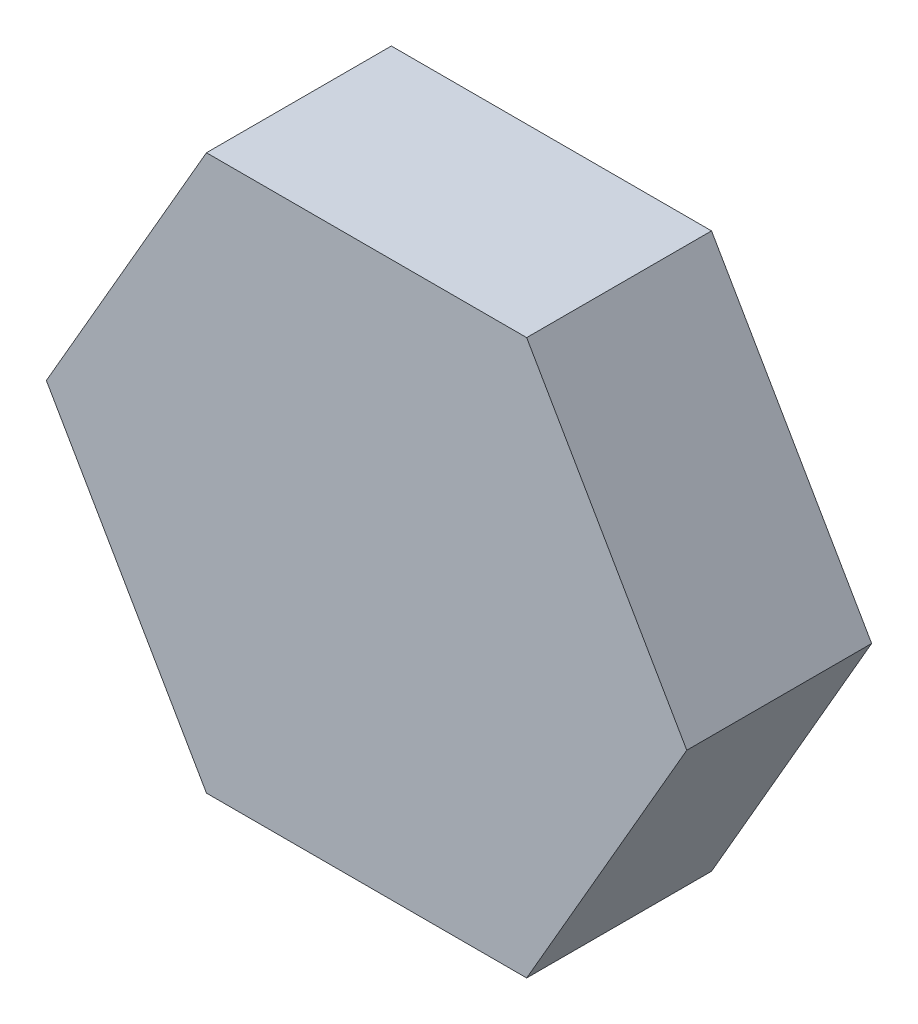
ISO-10303-21;
HEADER;
FILE_DESCRIPTION(('STEP AP214'),'2;1');
FILE_NAME('part.step','',(''),(''),'','','');
FILE_SCHEMA(('AUTOMOTIVE_DESIGN { 1 0 10303 214 1 1 1 1 }'));
ENDSEC;
DATA;
#1=APPLICATION_CONTEXT('core data for automotive mechanical design processes');
#2=APPLICATION_PROTOCOL_DEFINITION('international standard','automotive_design',2000,#1);
#3=PRODUCT_CONTEXT('',#1,'mechanical');
#4=PRODUCT('Part','Part','',(#3));
#5=PRODUCT_RELATED_PRODUCT_CATEGORY('part','',(#4));
#6=PRODUCT_DEFINITION_FORMATION('','',#4);
#7=PRODUCT_DEFINITION_CONTEXT('part definition',#1,'design');
#8=PRODUCT_DEFINITION('design','',#6,#7);
#9=PRODUCT_DEFINITION_SHAPE('','',#8);
#10=(LENGTH_UNIT() NAMED_UNIT(*) SI_UNIT(.MILLI.,.METRE.));
#11=(NAMED_UNIT(*) PLANE_ANGLE_UNIT() SI_UNIT($,.RADIAN.));
#12=(NAMED_UNIT(*) SI_UNIT($,.STERADIAN.) SOLID_ANGLE_UNIT());
#13=UNCERTAINTY_MEASURE_WITH_UNIT(LENGTH_MEASURE(1.E-05),#10,'distance_accuracy_value','');
#14=(GEOMETRIC_REPRESENTATION_CONTEXT(3) GLOBAL_UNCERTAINTY_ASSIGNED_CONTEXT((#13)) GLOBAL_UNIT_ASSIGNED_CONTEXT((#10,
#11,#12)) REPRESENTATION_CONTEXT('',''));
#15=CARTESIAN_POINT('',(0.,0.,0.));
#16=DIRECTION('',(0.,0.,1.));
#17=DIRECTION('',(1.,0.,0.));
#18=AXIS2_PLACEMENT_3D('',#15,#16,#17);
#19=CARTESIAN_POINT('',(17.3205080756888,0.,10.));
#20=DIRECTION('',(-0.866025403784438,-0.5,0.));
#21=DIRECTION('',(0.5,-0.866025403784438,0.));
#22=AXIS2_PLACEMENT_3D('',#19,#20,#21);
#23=PLANE('',#22);
#24=DIRECTION('',(-0.5,0.866025403784438,0.));
#25=VECTOR('',#24,1.);
#26=CARTESIAN_POINT('',(17.3205080756888,0.,0.));
#27=LINE('',#26,#25);
#28=CARTESIAN_POINT('',(17.3205080756888,0.,0.));
#29=VERTEX_POINT('',#28);
#30=CARTESIAN_POINT('',(8.66025403784439,15.,0.));
#31=VERTEX_POINT('',#30);
#32=EDGE_CURVE('E128',#29,#31,#27,.T.);
#33=ORIENTED_EDGE('',*,*,#32,.T.);
#34=DIRECTION('',(0.,0.,-1.));
#35=VECTOR('',#34,1.);
#36=CARTESIAN_POINT('',(8.66025403784439,15.,10.));
#37=LINE('',#36,#35);
#38=CARTESIAN_POINT('',(8.66025403784439,15.,10.));
#39=VERTEX_POINT('',#38);
#40=EDGE_CURVE('E11',#39,#31,#37,.T.);
#41=ORIENTED_EDGE('',*,*,#40,.F.);
#42=DIRECTION('',(-0.5,0.866025403784438,0.));
#43=VECTOR('',#42,1.);
#44=CARTESIAN_POINT('',(17.3205080756888,0.,10.));
#45=LINE('',#44,#43);
#46=CARTESIAN_POINT('',(17.3205080756888,0.,10.));
#47=VERTEX_POINT('',#46);
#48=EDGE_CURVE('E144',#47,#39,#45,.T.);
#49=ORIENTED_EDGE('',*,*,#48,.F.);
#50=DIRECTION('',(0.,0.,-1.));
#51=VECTOR('',#50,1.);
#52=CARTESIAN_POINT('',(17.3205080756888,0.,10.));
#53=LINE('',#52,#51);
#54=EDGE_CURVE('E124',#47,#29,#53,.T.);
#55=ORIENTED_EDGE('',*,*,#54,.T.);
#56=EDGE_LOOP('',(#33,#41,#49,#55));
#57=FACE_BOUND('',#56,.T.);
#58=ADVANCED_FACE('F39',(#57),#23,.F.);
#59=CARTESIAN_POINT('',(8.66025403784439,15.,10.));
#60=DIRECTION('',(0.,-1.,0.));
#61=DIRECTION('',(0.,0.,-1.));
#62=AXIS2_PLACEMENT_3D('',#59,#60,#61);
#63=PLANE('',#62);
#64=DIRECTION('',(-1.,0.,0.));
#65=VECTOR('',#64,1.);
#66=CARTESIAN_POINT('',(8.66025403784439,15.,0.));
#67=LINE('',#66,#65);
#68=CARTESIAN_POINT('',(-8.66025403784439,15.,0.));
#69=VERTEX_POINT('',#68);
#70=EDGE_CURVE('E132',#31,#69,#67,.T.);
#71=ORIENTED_EDGE('',*,*,#70,.T.);
#72=DIRECTION('',(0.,0.,-1.));
#73=VECTOR('',#72,1.);
#74=CARTESIAN_POINT('',(-8.66025403784439,15.,10.));
#75=LINE('',#74,#73);
#76=CARTESIAN_POINT('',(-8.66025403784439,15.,10.));
#77=VERTEX_POINT('',#76);
#78=EDGE_CURVE('E48',#77,#69,#75,.T.);
#79=ORIENTED_EDGE('',*,*,#78,.F.);
#80=DIRECTION('',(-1.,0.,0.));
#81=VECTOR('',#80,1.);
#82=CARTESIAN_POINT('',(8.66025403784439,15.,10.));
#83=LINE('',#82,#81);
#84=EDGE_CURVE('E93',#39,#77,#83,.T.);
#85=ORIENTED_EDGE('',*,*,#84,.F.);
#86=ORIENTED_EDGE('',*,*,#40,.T.);
#87=EDGE_LOOP('',(#71,#79,#85,#86));
#88=FACE_BOUND('',#87,.T.);
#89=ADVANCED_FACE('F172',(#88),#63,.F.);
#90=CARTESIAN_POINT('',(-8.66025403784439,15.,10.));
#91=DIRECTION('',(0.866025403784439,-0.5,0.));
#92=DIRECTION('',(0.5,0.866025403784439,0.));
#93=AXIS2_PLACEMENT_3D('',#90,#91,#92);
#94=PLANE('',#93);
#95=DIRECTION('',(-0.5,-0.866025403784439,0.));
#96=VECTOR('',#95,1.);
#97=CARTESIAN_POINT('',(-8.66025403784439,15.,0.));
#98=LINE('',#97,#96);
#99=CARTESIAN_POINT('',(-17.3205080756888,0.,0.));
#100=VERTEX_POINT('',#99);
#101=EDGE_CURVE('E135',#69,#100,#98,.T.);
#102=ORIENTED_EDGE('',*,*,#101,.T.);
#103=DIRECTION('',(0.,0.,-1.));
#104=VECTOR('',#103,1.);
#105=CARTESIAN_POINT('',(-17.3205080756888,0.,10.));
#106=LINE('',#105,#104);
#107=CARTESIAN_POINT('',(-17.3205080756888,0.,10.));
#108=VERTEX_POINT('',#107);
#109=EDGE_CURVE('E117',#108,#100,#106,.T.);
#110=ORIENTED_EDGE('',*,*,#109,.F.);
#111=DIRECTION('',(-0.5,-0.866025403784439,0.));
#112=VECTOR('',#111,1.);
#113=CARTESIAN_POINT('',(-8.66025403784439,15.,10.));
#114=LINE('',#113,#112);
#115=EDGE_CURVE('E106',#77,#108,#114,.T.);
#116=ORIENTED_EDGE('',*,*,#115,.F.);
#117=ORIENTED_EDGE('',*,*,#78,.T.);
#118=EDGE_LOOP('',(#102,#110,#116,#117));
#119=FACE_BOUND('',#118,.T.);
#120=ADVANCED_FACE('F154',(#119),#94,.F.);
#121=CARTESIAN_POINT('',(-17.3205080756888,0.,10.));
#122=DIRECTION('',(0.866025403784438,0.500000000000001,0.));
#123=DIRECTION('',(-0.500000000000001,0.866025403784438,0.));
#124=AXIS2_PLACEMENT_3D('',#121,#122,#123);
#125=PLANE('',#124);
#126=DIRECTION('',(0.500000000000001,-0.866025403784438,0.));
#127=VECTOR('',#126,1.);
#128=CARTESIAN_POINT('',(-17.3205080756888,0.,0.));
#129=LINE('',#128,#127);
#130=CARTESIAN_POINT('',(-8.66025403784438,-15.,0.));
#131=VERTEX_POINT('',#130);
#132=EDGE_CURVE('E115',#100,#131,#129,.T.);
#133=ORIENTED_EDGE('',*,*,#132,.T.);
#134=DIRECTION('',(0.,0.,-1.));
#135=VECTOR('',#134,1.);
#136=CARTESIAN_POINT('',(-8.66025403784438,-15.,10.));
#137=LINE('',#136,#135);
#138=CARTESIAN_POINT('',(-8.66025403784438,-15.,10.));
#139=VERTEX_POINT('',#138);
#140=EDGE_CURVE('E112',#139,#131,#137,.T.);
#141=ORIENTED_EDGE('',*,*,#140,.F.);
#142=DIRECTION('',(0.500000000000001,-0.866025403784438,0.));
#143=VECTOR('',#142,1.);
#144=CARTESIAN_POINT('',(-17.3205080756888,0.,10.));
#145=LINE('',#144,#143);
#146=EDGE_CURVE('E100',#108,#139,#145,.T.);
#147=ORIENTED_EDGE('',*,*,#146,.F.);
#148=ORIENTED_EDGE('',*,*,#109,.T.);
#149=EDGE_LOOP('',(#133,#141,#147,#148));
#150=FACE_BOUND('',#149,.T.);
#151=ADVANCED_FACE('F113',(#150),#125,.F.);
#152=CARTESIAN_POINT('',(-8.66025403784438,-15.,10.));
#153=DIRECTION('',(0.,1.,0.));
#154=DIRECTION('',(-1.,0.,0.));
#155=AXIS2_PLACEMENT_3D('',#152,#153,#154);
#156=PLANE('',#155);
#157=DIRECTION('',(1.,0.,0.));
#158=VECTOR('',#157,1.);
#159=CARTESIAN_POINT('',(-8.66025403784438,-15.,0.));
#160=LINE('',#159,#158);
#161=CARTESIAN_POINT('',(8.66025403784439,-15.,0.));
#162=VERTEX_POINT('',#161);
#163=EDGE_CURVE('E79',#131,#162,#160,.T.);
#164=ORIENTED_EDGE('',*,*,#163,.T.);
#165=DIRECTION('',(0.,0.,-1.));
#166=VECTOR('',#165,1.);
#167=CARTESIAN_POINT('',(8.66025403784439,-15.,10.));
#168=LINE('',#167,#166);
#169=CARTESIAN_POINT('',(8.66025403784439,-15.,10.));
#170=VERTEX_POINT('',#169);
#171=EDGE_CURVE('E118',#170,#162,#168,.T.);
#172=ORIENTED_EDGE('',*,*,#171,.F.);
#173=DIRECTION('',(1.,0.,0.));
#174=VECTOR('',#173,1.);
#175=CARTESIAN_POINT('',(-8.66025403784438,-15.,10.));
#176=LINE('',#175,#174);
#177=EDGE_CURVE('E104',#139,#170,#176,.T.);
#178=ORIENTED_EDGE('',*,*,#177,.F.);
#179=ORIENTED_EDGE('',*,*,#140,.T.);
#180=EDGE_LOOP('',(#164,#172,#178,#179));
#181=FACE_BOUND('',#180,.T.);
#182=ADVANCED_FACE('F120',(#181),#156,.F.);
#183=CARTESIAN_POINT('',(8.66025403784439,-15.,10.));
#184=DIRECTION('',(-0.866025403784439,0.5,0.));
#185=DIRECTION('',(-0.5,-0.866025403784439,0.));
#186=AXIS2_PLACEMENT_3D('',#183,#184,#185);
#187=PLANE('',#186);
#188=DIRECTION('',(0.5,0.866025403784439,0.));
#189=VECTOR('',#188,1.);
#190=CARTESIAN_POINT('',(8.66025403784439,-15.,0.));
#191=LINE('',#190,#189);
#192=EDGE_CURVE('E85',#162,#29,#191,.T.);
#193=ORIENTED_EDGE('',*,*,#192,.T.);
#194=ORIENTED_EDGE('',*,*,#54,.F.);
#195=DIRECTION('',(0.5,0.866025403784439,0.));
#196=VECTOR('',#195,1.);
#197=CARTESIAN_POINT('',(8.66025403784439,-15.,10.));
#198=LINE('',#197,#196);
#199=EDGE_CURVE('E56',#170,#47,#198,.T.);
#200=ORIENTED_EDGE('',*,*,#199,.F.);
#201=ORIENTED_EDGE('',*,*,#171,.T.);
#202=EDGE_LOOP('',(#193,#194,#200,#201));
#203=FACE_BOUND('',#202,.T.);
#204=ADVANCED_FACE('F161',(#203),#187,.F.);
#205=CARTESIAN_POINT('',(0.,0.,10.));
#206=DIRECTION('',(0.,0.,1.));
#207=DIRECTION('',(1.,0.,0.));
#208=AXIS2_PLACEMENT_3D('',#205,#206,#207);
#209=PLANE('',#208);
#210=ORIENTED_EDGE('',*,*,#48,.T.);
#211=ORIENTED_EDGE('',*,*,#84,.T.);
#212=ORIENTED_EDGE('',*,*,#115,.T.);
#213=ORIENTED_EDGE('',*,*,#146,.T.);
#214=ORIENTED_EDGE('',*,*,#177,.T.);
#215=ORIENTED_EDGE('',*,*,#199,.T.);
#216=EDGE_LOOP('',(#210,#211,#212,#213,#214,#215));
#217=FACE_BOUND('',#216,.T.);
#218=ADVANCED_FACE('F102',(#217),#209,.T.);
#219=CARTESIAN_POINT('',(0.,0.,0.));
#220=DIRECTION('',(0.,0.,1.));
#221=DIRECTION('',(1.,0.,0.));
#222=AXIS2_PLACEMENT_3D('',#219,#220,#221);
#223=PLANE('',#222);
#224=ORIENTED_EDGE('',*,*,#32,.F.);
#225=ORIENTED_EDGE('',*,*,#192,.F.);
#226=ORIENTED_EDGE('',*,*,#163,.F.);
#227=ORIENTED_EDGE('',*,*,#132,.F.);
#228=ORIENTED_EDGE('',*,*,#101,.F.);
#229=ORIENTED_EDGE('',*,*,#70,.F.);
#230=EDGE_LOOP('',(#224,#225,#226,#227,#228,#229));
#231=FACE_BOUND('',#230,.T.);
#232=ADVANCED_FACE('F157',(#231),#223,.F.);
#233=CLOSED_SHELL('',(#58,#89,#120,#151,#182,#204,#218,#232));
#234=MANIFOLD_SOLID_BREP('B2',#233);
#235=ADVANCED_BREP_SHAPE_REPRESENTATION('',(#18,#234),#14);
#236=SHAPE_DEFINITION_REPRESENTATION(#9,#235);
ENDSEC;
END-ISO-10303-21;
